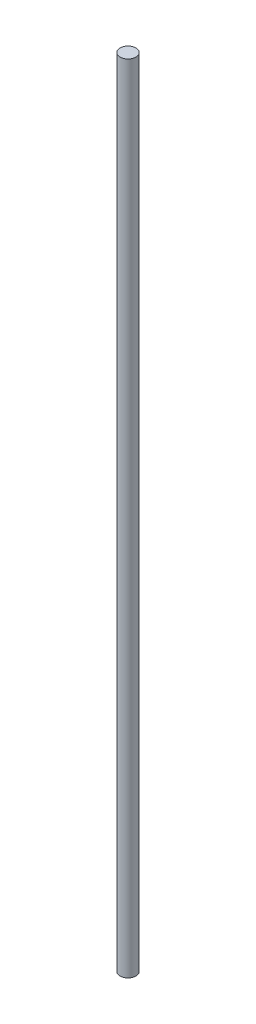
ISO-10303-21;
HEADER;
FILE_DESCRIPTION(('STEP AP214'),'2;1');
FILE_NAME('part.step','',(''),(''),'','','');
FILE_SCHEMA(('AUTOMOTIVE_DESIGN { 1 0 10303 214 1 1 1 1 }'));
ENDSEC;
DATA;
#1=APPLICATION_CONTEXT('core data for automotive mechanical design processes');
#2=APPLICATION_PROTOCOL_DEFINITION('international standard','automotive_design',2000,#1);
#3=PRODUCT_CONTEXT('',#1,'mechanical');
#4=PRODUCT('Part','Part','',(#3));
#5=PRODUCT_RELATED_PRODUCT_CATEGORY('part','',(#4));
#6=PRODUCT_DEFINITION_FORMATION('','',#4);
#7=PRODUCT_DEFINITION_CONTEXT('part definition',#1,'design');
#8=PRODUCT_DEFINITION('design','',#6,#7);
#9=PRODUCT_DEFINITION_SHAPE('','',#8);
#10=(LENGTH_UNIT() NAMED_UNIT(*) SI_UNIT(.MILLI.,.METRE.));
#11=(NAMED_UNIT(*) PLANE_ANGLE_UNIT() SI_UNIT($,.RADIAN.));
#12=(NAMED_UNIT(*) SI_UNIT($,.STERADIAN.) SOLID_ANGLE_UNIT());
#13=UNCERTAINTY_MEASURE_WITH_UNIT(LENGTH_MEASURE(1.E-05),#10,'distance_accuracy_value','');
#14=(GEOMETRIC_REPRESENTATION_CONTEXT(3) GLOBAL_UNCERTAINTY_ASSIGNED_CONTEXT((#13)) GLOBAL_UNIT_ASSIGNED_CONTEXT((#10,
#11,#12)) REPRESENTATION_CONTEXT('',''));
#15=CARTESIAN_POINT('',(0.,0.,0.));
#16=DIRECTION('',(0.,0.,1.));
#17=DIRECTION('',(1.,0.,0.));
#18=AXIS2_PLACEMENT_3D('',#15,#16,#17);
#19=CARTESIAN_POINT('',(0.,400.,0.));
#20=DIRECTION('',(0.,-1.,0.));
#21=DIRECTION('',(0.,0.,-1.));
#22=AXIS2_PLACEMENT_3D('',#19,#20,#21);
#23=CYLINDRICAL_SURFACE('',#22,4.);
#24=CARTESIAN_POINT('',(0.,400.,0.));
#25=DIRECTION('',(0.,1.,0.));
#26=DIRECTION('',(0.,0.,1.));
#27=AXIS2_PLACEMENT_3D('',#24,#25,#26);
#28=CIRCLE('',#27,4.);
#29=CARTESIAN_POINT('',(0.,400.,4.));
#30=VERTEX_POINT('',#29);
#31=EDGE_CURVE('E10',#30,#30,#28,.T.);
#32=ORIENTED_EDGE('',*,*,#31,.F.);
#33=EDGE_LOOP('',(#32));
#34=FACE_BOUND('',#33,.T.);
#35=CARTESIAN_POINT('',(0.,0.,0.));
#36=DIRECTION('',(0.,1.,0.));
#37=DIRECTION('',(0.,0.,1.));
#38=AXIS2_PLACEMENT_3D('',#35,#36,#37);
#39=CIRCLE('',#38,4.);
#40=CARTESIAN_POINT('',(0.,0.,4.));
#41=VERTEX_POINT('',#40);
#42=EDGE_CURVE('E35',#41,#41,#39,.T.);
#43=ORIENTED_EDGE('',*,*,#42,.T.);
#44=EDGE_LOOP('',(#43));
#45=FACE_BOUND('',#44,.T.);
#46=ADVANCED_FACE('F32',(#34,#45),#23,.T.);
#47=CARTESIAN_POINT('',(0.,400.,0.));
#48=DIRECTION('',(0.,1.,0.));
#49=DIRECTION('',(0.,0.,1.));
#50=AXIS2_PLACEMENT_3D('',#47,#48,#49);
#51=PLANE('',#50);
#52=ORIENTED_EDGE('',*,*,#31,.T.);
#53=EDGE_LOOP('',(#52));
#54=FACE_BOUND('',#53,.T.);
#55=ADVANCED_FACE('F47',(#54),#51,.T.);
#56=CARTESIAN_POINT('',(0.,0.,0.));
#57=DIRECTION('',(0.,1.,0.));
#58=DIRECTION('',(0.,0.,1.));
#59=AXIS2_PLACEMENT_3D('',#56,#57,#58);
#60=PLANE('',#59);
#61=ORIENTED_EDGE('',*,*,#42,.F.);
#62=EDGE_LOOP('',(#61));
#63=FACE_BOUND('',#62,.T.);
#64=ADVANCED_FACE('F45',(#63),#60,.F.);
#65=CLOSED_SHELL('',(#46,#55,#64));
#66=MANIFOLD_SOLID_BREP('B2',#65);
#67=ADVANCED_BREP_SHAPE_REPRESENTATION('',(#18,#66),#14);
#68=SHAPE_DEFINITION_REPRESENTATION(#9,#67);
ENDSEC;
END-ISO-10303-21;
